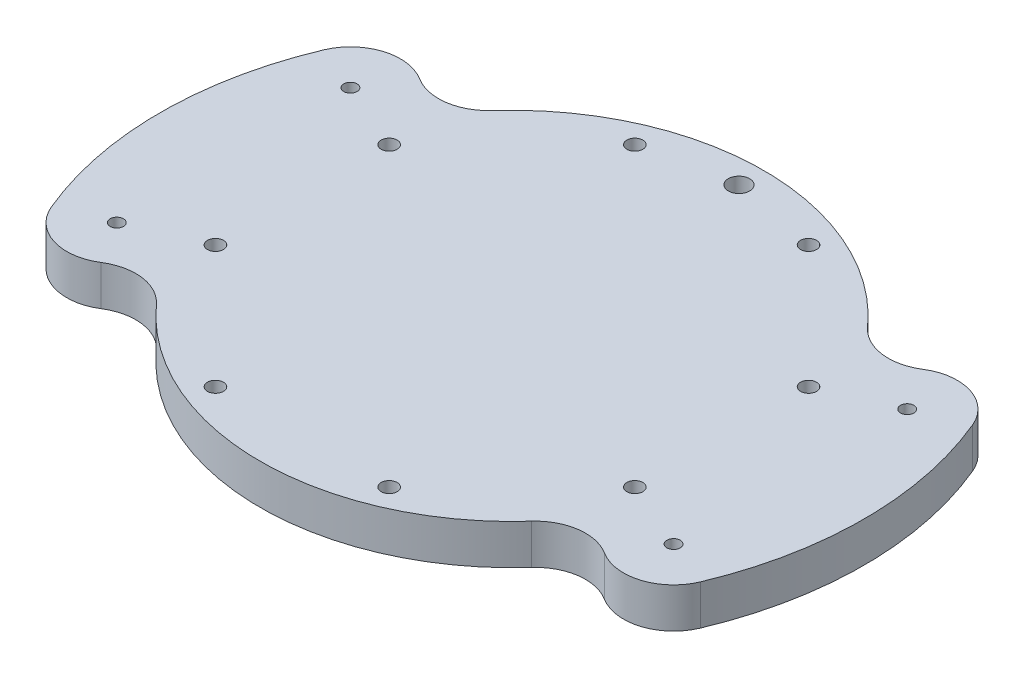
ISO-10303-21;
HEADER;
FILE_DESCRIPTION(('STEP AP214'),'2;1');
FILE_NAME('part.step','',(''),(''),'','','');
FILE_SCHEMA(('AUTOMOTIVE_DESIGN { 1 0 10303 214 1 1 1 1 }'));
ENDSEC;
DATA;
#1=APPLICATION_CONTEXT('core data for automotive mechanical design processes');
#2=APPLICATION_PROTOCOL_DEFINITION('international standard','automotive_design',2000,#1);
#3=PRODUCT_CONTEXT('',#1,'mechanical');
#4=PRODUCT('Part','Part','',(#3));
#5=PRODUCT_RELATED_PRODUCT_CATEGORY('part','',(#4));
#6=PRODUCT_DEFINITION_FORMATION('','',#4);
#7=PRODUCT_DEFINITION_CONTEXT('part definition',#1,'design');
#8=PRODUCT_DEFINITION('design','',#6,#7);
#9=PRODUCT_DEFINITION_SHAPE('','',#8);
#10=(LENGTH_UNIT() NAMED_UNIT(*) SI_UNIT(.MILLI.,.METRE.));
#11=(NAMED_UNIT(*) PLANE_ANGLE_UNIT() SI_UNIT($,.RADIAN.));
#12=(NAMED_UNIT(*) SI_UNIT($,.STERADIAN.) SOLID_ANGLE_UNIT());
#13=UNCERTAINTY_MEASURE_WITH_UNIT(LENGTH_MEASURE(1.E-05),#10,'distance_accuracy_value','');
#14=(GEOMETRIC_REPRESENTATION_CONTEXT(3) GLOBAL_UNCERTAINTY_ASSIGNED_CONTEXT((#13)) GLOBAL_UNIT_ASSIGNED_CONTEXT((#10,
#11,#12)) REPRESENTATION_CONTEXT('',''));
#15=CARTESIAN_POINT('',(0.,0.,0.));
#16=DIRECTION('',(0.,0.,1.));
#17=DIRECTION('',(1.,0.,0.));
#18=AXIS2_PLACEMENT_3D('',#15,#16,#17);
#19=CARTESIAN_POINT('',(0.,6.,0.));
#20=DIRECTION('',(0.,-1.,0.));
#21=DIRECTION('',(0.,0.,-1.));
#22=AXIS2_PLACEMENT_3D('',#19,#20,#21);
#23=PLANE('',#22);
#24=CARTESIAN_POINT('',(-13.011236700413,6.,31.4119041053838));
#25=DIRECTION('',(0.,-1.,0.));
#26=DIRECTION('',(0.,0.,-1.));
#27=AXIS2_PLACEMENT_3D('',#24,#25,#26);
#28=CIRCLE('',#27,1.2);
#29=CARTESIAN_POINT('',(-13.011236700413,6.,30.2119041053838));
#30=VERTEX_POINT('',#29);
#31=EDGE_CURVE('E635',#30,#30,#28,.T.);
#32=ORIENTED_EDGE('',*,*,#31,.T.);
#33=EDGE_LOOP('',(#32));
#34=FACE_BOUND('',#33,.T.);
#35=CARTESIAN_POINT('',(13.0112367004131,6.,31.4119041053837));
#36=DIRECTION('',(0.,-1.,0.));
#37=DIRECTION('',(0.,0.,-1.));
#38=AXIS2_PLACEMENT_3D('',#35,#36,#37);
#39=CIRCLE('',#38,1.2);
#40=CARTESIAN_POINT('',(13.0112367004131,6.,30.2119041053837));
#41=VERTEX_POINT('',#40);
#42=EDGE_CURVE('E645',#41,#41,#39,.T.);
#43=ORIENTED_EDGE('',*,*,#42,.T.);
#44=EDGE_LOOP('',(#43));
#45=FACE_BOUND('',#44,.T.);
#46=CARTESIAN_POINT('',(31.4119041053838,6.,13.011236700413));
#47=DIRECTION('',(0.,-1.,0.));
#48=DIRECTION('',(0.,0.,-1.));
#49=AXIS2_PLACEMENT_3D('',#46,#47,#48);
#50=CIRCLE('',#49,1.2);
#51=CARTESIAN_POINT('',(31.4119041053838,6.,11.811236700413));
#52=VERTEX_POINT('',#51);
#53=EDGE_CURVE('E654',#52,#52,#50,.T.);
#54=ORIENTED_EDGE('',*,*,#53,.T.);
#55=EDGE_LOOP('',(#54));
#56=FACE_BOUND('',#55,.T.);
#57=CARTESIAN_POINT('',(31.4119041053837,6.,-13.0112367004131));
#58=DIRECTION('',(0.,-1.,0.));
#59=DIRECTION('',(0.,0.,-1.));
#60=AXIS2_PLACEMENT_3D('',#57,#58,#59);
#61=CIRCLE('',#60,1.2);
#62=CARTESIAN_POINT('',(31.4119041053837,6.,-14.2112367004131));
#63=VERTEX_POINT('',#62);
#64=EDGE_CURVE('E663',#63,#63,#61,.T.);
#65=ORIENTED_EDGE('',*,*,#64,.T.);
#66=EDGE_LOOP('',(#65));
#67=FACE_BOUND('',#66,.T.);
#68=CARTESIAN_POINT('',(13.011236700413,6.,-31.4119041053838));
#69=DIRECTION('',(0.,-1.,0.));
#70=DIRECTION('',(0.,0.,-1.));
#71=AXIS2_PLACEMENT_3D('',#68,#69,#70);
#72=CIRCLE('',#71,1.2);
#73=CARTESIAN_POINT('',(13.011236700413,6.,-32.6119041053838));
#74=VERTEX_POINT('',#73);
#75=EDGE_CURVE('E672',#74,#74,#72,.T.);
#76=ORIENTED_EDGE('',*,*,#75,.T.);
#77=EDGE_LOOP('',(#76));
#78=FACE_BOUND('',#77,.T.);
#79=CARTESIAN_POINT('',(-13.0112367004131,6.,-31.4119041053837));
#80=DIRECTION('',(0.,-1.,0.));
#81=DIRECTION('',(0.,0.,-1.));
#82=AXIS2_PLACEMENT_3D('',#79,#80,#81);
#83=CIRCLE('',#82,1.2);
#84=CARTESIAN_POINT('',(-13.0112367004131,6.,-32.6119041053837));
#85=VERTEX_POINT('',#84);
#86=EDGE_CURVE('E681',#85,#85,#83,.T.);
#87=ORIENTED_EDGE('',*,*,#86,.T.);
#88=EDGE_LOOP('',(#87));
#89=FACE_BOUND('',#88,.T.);
#90=CARTESIAN_POINT('',(-31.4119041053838,6.,-13.011236700413));
#91=DIRECTION('',(0.,-1.,0.));
#92=DIRECTION('',(0.,0.,-1.));
#93=AXIS2_PLACEMENT_3D('',#90,#91,#92);
#94=CIRCLE('',#93,1.2);
#95=CARTESIAN_POINT('',(-31.4119041053838,6.,-14.211236700413));
#96=VERTEX_POINT('',#95);
#97=EDGE_CURVE('E690',#96,#96,#94,.T.);
#98=ORIENTED_EDGE('',*,*,#97,.T.);
#99=EDGE_LOOP('',(#98));
#100=FACE_BOUND('',#99,.T.);
#101=CARTESIAN_POINT('',(-31.4119041053837,6.,13.0112367004131));
#102=DIRECTION('',(0.,-1.,0.));
#103=DIRECTION('',(0.,0.,-1.));
#104=AXIS2_PLACEMENT_3D('',#101,#102,#103);
#105=CIRCLE('',#104,1.2);
#106=CARTESIAN_POINT('',(-31.4119041053837,6.,11.8112367004131));
#107=VERTEX_POINT('',#106);
#108=EDGE_CURVE('E225',#107,#107,#105,.T.);
#109=ORIENTED_EDGE('',*,*,#108,.T.);
#110=EDGE_LOOP('',(#109));
#111=FACE_BOUND('',#110,.T.);
#112=CARTESIAN_POINT('',(0.,6.,-34.));
#113=DIRECTION('',(0.,1.,0.));
#114=DIRECTION('',(0.,0.,1.));
#115=AXIS2_PLACEMENT_3D('',#112,#113,#114);
#116=CIRCLE('',#115,1.6);
#117=CARTESIAN_POINT('',(0.,6.,-32.4));
#118=VERTEX_POINT('',#117);
#119=EDGE_CURVE('E220',#118,#118,#116,.T.);
#120=ORIENTED_EDGE('',*,*,#119,.F.);
#121=EDGE_LOOP('',(#120));
#122=FACE_BOUND('',#121,.T.);
#123=CARTESIAN_POINT('',(-41.7019259147584,6.,-17.5));
#124=DIRECTION('',(0.,1.,0.));
#125=DIRECTION('',(0.,0.,-1.));
#126=AXIS2_PLACEMENT_3D('',#123,#124,#125);
#127=CIRCLE('',#126,0.999999999999998);
#128=CARTESIAN_POINT('',(-41.7019259147584,6.,-18.5));
#129=VERTEX_POINT('',#128);
#130=EDGE_CURVE('E236',#129,#129,#127,.T.);
#131=ORIENTED_EDGE('',*,*,#130,.F.);
#132=EDGE_LOOP('',(#131));
#133=FACE_BOUND('',#132,.T.);
#134=CARTESIAN_POINT('',(0.,6.,0.));
#135=DIRECTION('',(0.,1.,0.));
#136=DIRECTION('',(0.,0.,1.));
#137=AXIS2_PLACEMENT_3D('',#134,#135,#136);
#138=CIRCLE('',#137,37.725);
#139=CARTESIAN_POINT('',(-28.0981033127079,6.,25.1728467843506));
#140=VERTEX_POINT('',#139);
#141=CARTESIAN_POINT('',(28.0981033127079,6.,25.1728467843506));
#142=VERTEX_POINT('',#141);
#143=EDGE_CURVE('E163',#140,#142,#138,.T.);
#144=ORIENTED_EDGE('',*,*,#143,.T.);
#145=CARTESIAN_POINT('',(33.6842073510197,6.,30.1773888885953));
#146=DIRECTION('',(0.,-1.,0.));
#147=DIRECTION('',(0.,0.,-1.));
#148=AXIS2_PLACEMENT_3D('',#145,#146,#147);
#149=CIRCLE('',#148,7.5);
#150=CARTESIAN_POINT('',(37.693066632889,6.,23.8386944442976));
#151=VERTEX_POINT('',#150);
#152=EDGE_CURVE('E50',#142,#151,#149,.T.);
#153=ORIENTED_EDGE('',*,*,#152,.T.);
#154=CARTESIAN_POINT('',(41.7019259147584,6.,17.5));
#155=DIRECTION('',(0.,-1.,0.));
#156=DIRECTION('',(0.,0.,-1.));
#157=AXIS2_PLACEMENT_3D('',#154,#155,#156);
#158=CIRCLE('',#157,7.5);
#159=CARTESIAN_POINT('',(48.6176681891794,6.,20.4021558872305));
#160=VERTEX_POINT('',#159);
#161=EDGE_CURVE('E179',#151,#160,#158,.F.);
#162=ORIENTED_EDGE('',*,*,#161,.T.);
#163=CARTESIAN_POINT('',(0.,6.,0.));
#164=DIRECTION('',(0.,1.,0.));
#165=DIRECTION('',(0.,0.,-1.));
#166=AXIS2_PLACEMENT_3D('',#163,#164,#165);
#167=CIRCLE('',#166,52.725);
#168=CARTESIAN_POINT('',(48.6176681891794,6.,-20.4021558872305));
#169=VERTEX_POINT('',#168);
#170=EDGE_CURVE('E145',#160,#169,#167,.T.);
#171=ORIENTED_EDGE('',*,*,#170,.T.);
#172=CARTESIAN_POINT('',(41.7019259147584,6.,-17.5));
#173=DIRECTION('',(0.,-1.,0.));
#174=DIRECTION('',(0.,0.,-1.));
#175=AXIS2_PLACEMENT_3D('',#172,#173,#174);
#176=CIRCLE('',#175,7.5);
#177=CARTESIAN_POINT('',(37.693066632889,6.,-23.8386944442976));
#178=VERTEX_POINT('',#177);
#179=EDGE_CURVE('E175',#169,#178,#176,.F.);
#180=ORIENTED_EDGE('',*,*,#179,.T.);
#181=CARTESIAN_POINT('',(33.6842073510197,6.,-30.1773888885953));
#182=DIRECTION('',(0.,-1.,0.));
#183=DIRECTION('',(0.,0.,-1.));
#184=AXIS2_PLACEMENT_3D('',#181,#182,#183);
#185=CIRCLE('',#184,7.5);
#186=CARTESIAN_POINT('',(28.0981033127079,6.,-25.1728467843506));
#187=VERTEX_POINT('',#186);
#188=EDGE_CURVE('E203',#178,#187,#185,.T.);
#189=ORIENTED_EDGE('',*,*,#188,.T.);
#190=CARTESIAN_POINT('',(0.,6.,0.));
#191=DIRECTION('',(0.,1.,0.));
#192=DIRECTION('',(0.,0.,-1.));
#193=AXIS2_PLACEMENT_3D('',#190,#191,#192);
#194=CIRCLE('',#193,37.725);
#195=CARTESIAN_POINT('',(-28.0981033127079,6.,-25.1728467843506));
#196=VERTEX_POINT('',#195);
#197=EDGE_CURVE('E250',#187,#196,#194,.T.);
#198=ORIENTED_EDGE('',*,*,#197,.T.);
#199=CARTESIAN_POINT('',(-33.6842073510197,6.,-30.1773888885953));
#200=DIRECTION('',(0.,-1.,0.));
#201=DIRECTION('',(0.,0.,-1.));
#202=AXIS2_PLACEMENT_3D('',#199,#200,#201);
#203=CIRCLE('',#202,7.5);
#204=CARTESIAN_POINT('',(-37.693066632889,6.,-23.8386944442976));
#205=VERTEX_POINT('',#204);
#206=EDGE_CURVE('E11',#196,#205,#203,.T.);
#207=ORIENTED_EDGE('',*,*,#206,.T.);
#208=CARTESIAN_POINT('',(-41.7019259147584,6.,-17.5));
#209=DIRECTION('',(0.,-1.,0.));
#210=DIRECTION('',(0.,0.,-1.));
#211=AXIS2_PLACEMENT_3D('',#208,#209,#210);
#212=CIRCLE('',#211,7.5);
#213=CARTESIAN_POINT('',(-48.6176681891794,6.,-20.4021558872305));
#214=VERTEX_POINT('',#213);
#215=EDGE_CURVE('E134',#205,#214,#212,.F.);
#216=ORIENTED_EDGE('',*,*,#215,.T.);
#217=CARTESIAN_POINT('',(0.,6.,0.));
#218=DIRECTION('',(0.,1.,0.));
#219=DIRECTION('',(0.,0.,1.));
#220=AXIS2_PLACEMENT_3D('',#217,#218,#219);
#221=CIRCLE('',#220,52.725);
#222=CARTESIAN_POINT('',(-48.6176681891794,6.,20.4021558872305));
#223=VERTEX_POINT('',#222);
#224=EDGE_CURVE('E252',#214,#223,#221,.T.);
#225=ORIENTED_EDGE('',*,*,#224,.T.);
#226=CARTESIAN_POINT('',(-41.7019259147584,6.,17.5));
#227=DIRECTION('',(0.,-1.,0.));
#228=DIRECTION('',(0.,0.,-1.));
#229=AXIS2_PLACEMENT_3D('',#226,#227,#228);
#230=CIRCLE('',#229,7.5);
#231=CARTESIAN_POINT('',(-37.693066632889,6.,23.8386944442976));
#232=VERTEX_POINT('',#231);
#233=EDGE_CURVE('E177',#223,#232,#230,.F.);
#234=ORIENTED_EDGE('',*,*,#233,.T.);
#235=CARTESIAN_POINT('',(-33.6842073510197,6.,30.1773888885953));
#236=DIRECTION('',(0.,-1.,0.));
#237=DIRECTION('',(0.,0.,-1.));
#238=AXIS2_PLACEMENT_3D('',#235,#236,#237);
#239=CIRCLE('',#238,7.5);
#240=EDGE_CURVE('E199',#232,#140,#239,.T.);
#241=ORIENTED_EDGE('',*,*,#240,.T.);
#242=EDGE_LOOP('',(#144,#153,#162,#171,#180,#189,#198,#207,#216,#225,#234,#241));
#243=FACE_BOUND('',#242,.T.);
#244=CARTESIAN_POINT('',(41.7019259147584,6.,-17.5));
#245=DIRECTION('',(0.,1.,0.));
#246=DIRECTION('',(0.,0.,1.));
#247=AXIS2_PLACEMENT_3D('',#244,#245,#246);
#248=CIRCLE('',#247,0.999999999999998);
#249=CARTESIAN_POINT('',(41.7019259147584,6.,-16.5));
#250=VERTEX_POINT('',#249);
#251=EDGE_CURVE('E154',#250,#250,#248,.T.);
#252=ORIENTED_EDGE('',*,*,#251,.F.);
#253=EDGE_LOOP('',(#252));
#254=FACE_BOUND('',#253,.T.);
#255=CARTESIAN_POINT('',(41.7019259147584,6.,17.5));
#256=DIRECTION('',(0.,1.,0.));
#257=DIRECTION('',(0.,0.,1.));
#258=AXIS2_PLACEMENT_3D('',#255,#256,#257);
#259=CIRCLE('',#258,0.999999999999998);
#260=CARTESIAN_POINT('',(41.7019259147584,6.,18.5));
#261=VERTEX_POINT('',#260);
#262=EDGE_CURVE('E242',#261,#261,#259,.T.);
#263=ORIENTED_EDGE('',*,*,#262,.F.);
#264=EDGE_LOOP('',(#263));
#265=FACE_BOUND('',#264,.T.);
#266=CARTESIAN_POINT('',(-41.7019259147584,6.,17.5));
#267=DIRECTION('',(0.,1.,0.));
#268=DIRECTION('',(0.,0.,-1.));
#269=AXIS2_PLACEMENT_3D('',#266,#267,#268);
#270=CIRCLE('',#269,0.999999999999998);
#271=CARTESIAN_POINT('',(-41.7019259147584,6.,16.5));
#272=VERTEX_POINT('',#271);
#273=EDGE_CURVE('E230',#272,#272,#270,.T.);
#274=ORIENTED_EDGE('',*,*,#273,.F.);
#275=EDGE_LOOP('',(#274));
#276=FACE_BOUND('',#275,.T.);
#277=ADVANCED_FACE('F33',(#34,#45,#56,#67,#78,#89,#100,#111,#122,#133,#243,#254,#265,#276),#23,.F.);
#278=CARTESIAN_POINT('',(0.,0.,0.));
#279=DIRECTION('',(0.,-1.,0.));
#280=DIRECTION('',(0.,0.,-1.));
#281=AXIS2_PLACEMENT_3D('',#278,#279,#280);
#282=PLANE('',#281);
#283=CARTESIAN_POINT('',(-13.011236700413,0.,31.4119041053838));
#284=DIRECTION('',(0.,-1.,0.));
#285=DIRECTION('',(0.,0.,-1.));
#286=AXIS2_PLACEMENT_3D('',#283,#284,#285);
#287=CIRCLE('',#286,2.2);
#288=CARTESIAN_POINT('',(-13.011236700413,0.,29.2119041053838));
#289=VERTEX_POINT('',#288);
#290=EDGE_CURVE('E633',#289,#289,#287,.T.);
#291=ORIENTED_EDGE('',*,*,#290,.F.);
#292=EDGE_LOOP('',(#291));
#293=FACE_BOUND('',#292,.T.);
#294=CARTESIAN_POINT('',(13.0112367004131,0.,31.4119041053837));
#295=DIRECTION('',(0.,-1.,0.));
#296=DIRECTION('',(0.,0.,-1.));
#297=AXIS2_PLACEMENT_3D('',#294,#295,#296);
#298=CIRCLE('',#297,2.2);
#299=CARTESIAN_POINT('',(13.0112367004131,0.,29.2119041053837));
#300=VERTEX_POINT('',#299);
#301=EDGE_CURVE('E639',#300,#300,#298,.T.);
#302=ORIENTED_EDGE('',*,*,#301,.F.);
#303=EDGE_LOOP('',(#302));
#304=FACE_BOUND('',#303,.T.);
#305=CARTESIAN_POINT('',(31.4119041053838,0.,13.011236700413));
#306=DIRECTION('',(0.,-1.,0.));
#307=DIRECTION('',(0.,0.,-1.));
#308=AXIS2_PLACEMENT_3D('',#305,#306,#307);
#309=CIRCLE('',#308,2.2);
#310=CARTESIAN_POINT('',(31.4119041053838,0.,10.811236700413));
#311=VERTEX_POINT('',#310);
#312=EDGE_CURVE('E648',#311,#311,#309,.T.);
#313=ORIENTED_EDGE('',*,*,#312,.F.);
#314=EDGE_LOOP('',(#313));
#315=FACE_BOUND('',#314,.T.);
#316=CARTESIAN_POINT('',(31.4119041053837,0.,-13.0112367004131));
#317=DIRECTION('',(0.,-1.,0.));
#318=DIRECTION('',(0.,0.,-1.));
#319=AXIS2_PLACEMENT_3D('',#316,#317,#318);
#320=CIRCLE('',#319,2.2);
#321=CARTESIAN_POINT('',(31.4119041053837,0.,-15.2112367004131));
#322=VERTEX_POINT('',#321);
#323=EDGE_CURVE('E657',#322,#322,#320,.T.);
#324=ORIENTED_EDGE('',*,*,#323,.F.);
#325=EDGE_LOOP('',(#324));
#326=FACE_BOUND('',#325,.T.);
#327=CARTESIAN_POINT('',(13.011236700413,0.,-31.4119041053838));
#328=DIRECTION('',(0.,-1.,0.));
#329=DIRECTION('',(0.,0.,-1.));
#330=AXIS2_PLACEMENT_3D('',#327,#328,#329);
#331=CIRCLE('',#330,2.2);
#332=CARTESIAN_POINT('',(13.011236700413,0.,-33.6119041053838));
#333=VERTEX_POINT('',#332);
#334=EDGE_CURVE('E666',#333,#333,#331,.T.);
#335=ORIENTED_EDGE('',*,*,#334,.F.);
#336=EDGE_LOOP('',(#335));
#337=FACE_BOUND('',#336,.T.);
#338=CARTESIAN_POINT('',(-13.0112367004131,0.,-31.4119041053837));
#339=DIRECTION('',(0.,-1.,0.));
#340=DIRECTION('',(0.,0.,-1.));
#341=AXIS2_PLACEMENT_3D('',#338,#339,#340);
#342=CIRCLE('',#341,2.2);
#343=CARTESIAN_POINT('',(-13.0112367004131,0.,-33.6119041053837));
#344=VERTEX_POINT('',#343);
#345=EDGE_CURVE('E675',#344,#344,#342,.T.);
#346=ORIENTED_EDGE('',*,*,#345,.F.);
#347=EDGE_LOOP('',(#346));
#348=FACE_BOUND('',#347,.T.);
#349=CARTESIAN_POINT('',(-31.4119041053838,0.,-13.011236700413));
#350=DIRECTION('',(0.,-1.,0.));
#351=DIRECTION('',(0.,0.,-1.));
#352=AXIS2_PLACEMENT_3D('',#349,#350,#351);
#353=CIRCLE('',#352,2.2);
#354=CARTESIAN_POINT('',(-31.4119041053838,0.,-15.211236700413));
#355=VERTEX_POINT('',#354);
#356=EDGE_CURVE('E684',#355,#355,#353,.T.);
#357=ORIENTED_EDGE('',*,*,#356,.F.);
#358=EDGE_LOOP('',(#357));
#359=FACE_BOUND('',#358,.T.);
#360=CARTESIAN_POINT('',(-31.4119041053837,0.,13.0112367004131));
#361=DIRECTION('',(0.,-1.,0.));
#362=DIRECTION('',(0.,0.,-1.));
#363=AXIS2_PLACEMENT_3D('',#360,#361,#362);
#364=CIRCLE('',#363,2.2);
#365=CARTESIAN_POINT('',(-31.4119041053837,0.,10.8112367004131));
#366=VERTEX_POINT('',#365);
#367=EDGE_CURVE('E693',#366,#366,#364,.T.);
#368=ORIENTED_EDGE('',*,*,#367,.F.);
#369=EDGE_LOOP('',(#368));
#370=FACE_BOUND('',#369,.T.);
#371=CARTESIAN_POINT('',(0.,0.,-34.));
#372=DIRECTION('',(0.,1.,0.));
#373=DIRECTION('',(0.,0.,1.));
#374=AXIS2_PLACEMENT_3D('',#371,#372,#373);
#375=CIRCLE('',#374,1.6);
#376=CARTESIAN_POINT('',(0.,0.,-32.4));
#377=VERTEX_POINT('',#376);
#378=EDGE_CURVE('E215',#377,#377,#375,.T.);
#379=ORIENTED_EDGE('',*,*,#378,.T.);
#380=EDGE_LOOP('',(#379));
#381=FACE_BOUND('',#380,.T.);
#382=CARTESIAN_POINT('',(-41.7019259147584,0.,-17.5));
#383=DIRECTION('',(0.,1.,0.));
#384=DIRECTION('',(0.,0.,-1.));
#385=AXIS2_PLACEMENT_3D('',#382,#383,#384);
#386=CIRCLE('',#385,0.999999999999998);
#387=CARTESIAN_POINT('',(-41.7019259147584,0.,-18.5));
#388=VERTEX_POINT('',#387);
#389=EDGE_CURVE('E233',#388,#388,#386,.T.);
#390=ORIENTED_EDGE('',*,*,#389,.T.);
#391=EDGE_LOOP('',(#390));
#392=FACE_BOUND('',#391,.T.);
#393=CARTESIAN_POINT('',(0.,0.,0.));
#394=DIRECTION('',(0.,1.,0.));
#395=DIRECTION('',(0.,0.,-1.));
#396=AXIS2_PLACEMENT_3D('',#393,#394,#395);
#397=CIRCLE('',#396,52.725);
#398=CARTESIAN_POINT('',(48.6176681891794,0.,20.4021558872305));
#399=VERTEX_POINT('',#398);
#400=CARTESIAN_POINT('',(48.6176681891794,0.,-20.4021558872305));
#401=VERTEX_POINT('',#400);
#402=EDGE_CURVE('E142',#399,#401,#397,.T.);
#403=ORIENTED_EDGE('',*,*,#402,.F.);
#404=CARTESIAN_POINT('',(41.7019259147584,0.,17.5));
#405=DIRECTION('',(0.,-1.,0.));
#406=DIRECTION('',(0.,0.,-1.));
#407=AXIS2_PLACEMENT_3D('',#404,#405,#406);
#408=CIRCLE('',#407,7.5);
#409=CARTESIAN_POINT('',(37.693066632889,0.,23.8386944442976));
#410=VERTEX_POINT('',#409);
#411=EDGE_CURVE('E125',#399,#410,#408,.T.);
#412=ORIENTED_EDGE('',*,*,#411,.T.);
#413=CARTESIAN_POINT('',(33.6842073510197,0.,30.1773888885953));
#414=DIRECTION('',(0.,-1.,0.));
#415=DIRECTION('',(0.,0.,-1.));
#416=AXIS2_PLACEMENT_3D('',#413,#414,#415);
#417=CIRCLE('',#416,7.5);
#418=CARTESIAN_POINT('',(28.0981033127079,0.,25.1728467843506));
#419=VERTEX_POINT('',#418);
#420=EDGE_CURVE('E194',#410,#419,#417,.F.);
#421=ORIENTED_EDGE('',*,*,#420,.T.);
#422=CARTESIAN_POINT('',(0.,0.,0.));
#423=DIRECTION('',(0.,1.,0.));
#424=DIRECTION('',(0.,0.,1.));
#425=AXIS2_PLACEMENT_3D('',#422,#423,#424);
#426=CIRCLE('',#425,37.725);
#427=CARTESIAN_POINT('',(-28.0981033127079,0.,25.1728467843506));
#428=VERTEX_POINT('',#427);
#429=EDGE_CURVE('E168',#428,#419,#426,.T.);
#430=ORIENTED_EDGE('',*,*,#429,.F.);
#431=CARTESIAN_POINT('',(-33.6842073510197,0.,30.1773888885953));
#432=DIRECTION('',(0.,-1.,0.));
#433=DIRECTION('',(0.,0.,-1.));
#434=AXIS2_PLACEMENT_3D('',#431,#432,#433);
#435=CIRCLE('',#434,7.5);
#436=CARTESIAN_POINT('',(-37.693066632889,0.,23.8386944442976));
#437=VERTEX_POINT('',#436);
#438=EDGE_CURVE('E197',#428,#437,#435,.F.);
#439=ORIENTED_EDGE('',*,*,#438,.T.);
#440=CARTESIAN_POINT('',(-41.7019259147584,0.,17.5));
#441=DIRECTION('',(0.,-1.,0.));
#442=DIRECTION('',(0.,0.,-1.));
#443=AXIS2_PLACEMENT_3D('',#440,#441,#442);
#444=CIRCLE('',#443,7.5);
#445=CARTESIAN_POINT('',(-48.6176681891794,0.,20.4021558872305));
#446=VERTEX_POINT('',#445);
#447=EDGE_CURVE('E135',#437,#446,#444,.T.);
#448=ORIENTED_EDGE('',*,*,#447,.T.);
#449=CARTESIAN_POINT('',(0.,0.,0.));
#450=DIRECTION('',(0.,1.,0.));
#451=DIRECTION('',(0.,0.,1.));
#452=AXIS2_PLACEMENT_3D('',#449,#450,#451);
#453=CIRCLE('',#452,52.725);
#454=CARTESIAN_POINT('',(-48.6176681891794,0.,-20.4021558872305));
#455=VERTEX_POINT('',#454);
#456=EDGE_CURVE('E157',#455,#446,#453,.T.);
#457=ORIENTED_EDGE('',*,*,#456,.F.);
#458=CARTESIAN_POINT('',(-41.7019259147584,0.,-17.5));
#459=DIRECTION('',(0.,-1.,0.));
#460=DIRECTION('',(0.,0.,-1.));
#461=AXIS2_PLACEMENT_3D('',#458,#459,#460);
#462=CIRCLE('',#461,7.5);
#463=CARTESIAN_POINT('',(-37.693066632889,0.,-23.8386944442976));
#464=VERTEX_POINT('',#463);
#465=EDGE_CURVE('E146',#455,#464,#462,.T.);
#466=ORIENTED_EDGE('',*,*,#465,.T.);
#467=CARTESIAN_POINT('',(-33.6842073510197,0.,-30.1773888885953));
#468=DIRECTION('',(0.,-1.,0.));
#469=DIRECTION('',(0.,0.,-1.));
#470=AXIS2_PLACEMENT_3D('',#467,#468,#469);
#471=CIRCLE('',#470,7.5);
#472=CARTESIAN_POINT('',(-28.0981033127079,0.,-25.1728467843506));
#473=VERTEX_POINT('',#472);
#474=EDGE_CURVE('E42',#464,#473,#471,.F.);
#475=ORIENTED_EDGE('',*,*,#474,.T.);
#476=CARTESIAN_POINT('',(0.,0.,0.));
#477=DIRECTION('',(0.,1.,0.));
#478=DIRECTION('',(0.,0.,-1.));
#479=AXIS2_PLACEMENT_3D('',#476,#477,#478);
#480=CIRCLE('',#479,37.725);
#481=CARTESIAN_POINT('',(28.0981033127079,0.,-25.1728467843506));
#482=VERTEX_POINT('',#481);
#483=EDGE_CURVE('E153',#482,#473,#480,.T.);
#484=ORIENTED_EDGE('',*,*,#483,.F.);
#485=CARTESIAN_POINT('',(33.6842073510197,0.,-30.1773888885953));
#486=DIRECTION('',(0.,-1.,0.));
#487=DIRECTION('',(0.,0.,-1.));
#488=AXIS2_PLACEMENT_3D('',#485,#486,#487);
#489=CIRCLE('',#488,7.5);
#490=CARTESIAN_POINT('',(37.693066632889,0.,-23.8386944442976));
#491=VERTEX_POINT('',#490);
#492=EDGE_CURVE('E201',#482,#491,#489,.F.);
#493=ORIENTED_EDGE('',*,*,#492,.T.);
#494=CARTESIAN_POINT('',(41.7019259147584,0.,-17.5));
#495=DIRECTION('',(0.,-1.,0.));
#496=DIRECTION('',(0.,0.,-1.));
#497=AXIS2_PLACEMENT_3D('',#494,#495,#496);
#498=CIRCLE('',#497,7.5);
#499=EDGE_CURVE('E152',#491,#401,#498,.T.);
#500=ORIENTED_EDGE('',*,*,#499,.T.);
#501=EDGE_LOOP('',(#403,#412,#421,#430,#439,#448,#457,#466,#475,#484,#493,#500));
#502=FACE_BOUND('',#501,.T.);
#503=CARTESIAN_POINT('',(41.7019259147584,0.,-17.5));
#504=DIRECTION('',(0.,1.,0.));
#505=DIRECTION('',(0.,0.,1.));
#506=AXIS2_PLACEMENT_3D('',#503,#504,#505);
#507=CIRCLE('',#506,0.999999999999998);
#508=CARTESIAN_POINT('',(41.7019259147584,0.,-16.5));
#509=VERTEX_POINT('',#508);
#510=EDGE_CURVE('E160',#509,#509,#507,.T.);
#511=ORIENTED_EDGE('',*,*,#510,.T.);
#512=EDGE_LOOP('',(#511));
#513=FACE_BOUND('',#512,.T.);
#514=CARTESIAN_POINT('',(41.7019259147584,0.,17.5));
#515=DIRECTION('',(0.,1.,0.));
#516=DIRECTION('',(0.,0.,1.));
#517=AXIS2_PLACEMENT_3D('',#514,#515,#516);
#518=CIRCLE('',#517,0.999999999999998);
#519=CARTESIAN_POINT('',(41.7019259147584,0.,18.5));
#520=VERTEX_POINT('',#519);
#521=EDGE_CURVE('E239',#520,#520,#518,.T.);
#522=ORIENTED_EDGE('',*,*,#521,.T.);
#523=EDGE_LOOP('',(#522));
#524=FACE_BOUND('',#523,.T.);
#525=CARTESIAN_POINT('',(-41.7019259147584,0.,17.5));
#526=DIRECTION('',(0.,1.,0.));
#527=DIRECTION('',(0.,0.,-1.));
#528=AXIS2_PLACEMENT_3D('',#525,#526,#527);
#529=CIRCLE('',#528,0.999999999999998);
#530=CARTESIAN_POINT('',(-41.7019259147584,0.,16.5));
#531=VERTEX_POINT('',#530);
#532=EDGE_CURVE('E207',#531,#531,#529,.T.);
#533=ORIENTED_EDGE('',*,*,#532,.T.);
#534=EDGE_LOOP('',(#533));
#535=FACE_BOUND('',#534,.T.);
#536=ADVANCED_FACE('F149',(#293,#304,#315,#326,#337,#348,#359,#370,#381,#392,#502,#513,#524,
#535),#282,.T.);
#537=CARTESIAN_POINT('',(0.,6.,0.));
#538=DIRECTION('',(0.,-1.,0.));
#539=DIRECTION('',(0.,0.,-1.));
#540=AXIS2_PLACEMENT_3D('',#537,#538,#539);
#541=CYLINDRICAL_SURFACE('',#540,52.725);
#542=ORIENTED_EDGE('',*,*,#170,.F.);
#543=DIRECTION('',(0.,-1.,0.));
#544=VECTOR('',#543,1.);
#545=CARTESIAN_POINT('',(48.6176681891794,6.,20.4021558872305));
#546=LINE('',#545,#544);
#547=EDGE_CURVE('E129',#160,#399,#546,.T.);
#548=ORIENTED_EDGE('',*,*,#547,.T.);
#549=ORIENTED_EDGE('',*,*,#402,.T.);
#550=DIRECTION('',(0.,-1.,0.));
#551=VECTOR('',#550,1.);
#552=CARTESIAN_POINT('',(48.6176681891794,6.,-20.4021558872305));
#553=LINE('',#552,#551);
#554=EDGE_CURVE('E147',#401,#169,#553,.F.);
#555=ORIENTED_EDGE('',*,*,#554,.T.);
#556=EDGE_LOOP('',(#542,#548,#549,#555));
#557=FACE_BOUND('',#556,.T.);
#558=ADVANCED_FACE('F140',(#557),#541,.T.);
#559=CARTESIAN_POINT('',(0.,6.,0.));
#560=DIRECTION('',(0.,-1.,0.));
#561=DIRECTION('',(0.,0.,-1.));
#562=AXIS2_PLACEMENT_3D('',#559,#560,#561);
#563=CYLINDRICAL_SURFACE('',#562,37.725);
#564=ORIENTED_EDGE('',*,*,#197,.F.);
#565=DIRECTION('',(0.,-1.,0.));
#566=VECTOR('',#565,1.);
#567=CARTESIAN_POINT('',(28.0981033127079,6.,-25.1728467843506));
#568=LINE('',#567,#566);
#569=EDGE_CURVE('E192',#187,#482,#568,.T.);
#570=ORIENTED_EDGE('',*,*,#569,.T.);
#571=ORIENTED_EDGE('',*,*,#483,.T.);
#572=DIRECTION('',(0.,-1.,0.));
#573=VECTOR('',#572,1.);
#574=CARTESIAN_POINT('',(-28.0981033127079,6.,-25.1728467843506));
#575=LINE('',#574,#573);
#576=EDGE_CURVE('E190',#473,#196,#575,.F.);
#577=ORIENTED_EDGE('',*,*,#576,.T.);
#578=EDGE_LOOP('',(#564,#570,#571,#577));
#579=FACE_BOUND('',#578,.T.);
#580=ADVANCED_FACE('F268',(#579),#563,.T.);
#581=CARTESIAN_POINT('',(0.,6.,0.));
#582=DIRECTION('',(0.,-1.,0.));
#583=DIRECTION('',(0.,0.,-1.));
#584=AXIS2_PLACEMENT_3D('',#581,#582,#583);
#585=CYLINDRICAL_SURFACE('',#584,52.725);
#586=ORIENTED_EDGE('',*,*,#456,.T.);
#587=DIRECTION('',(0.,-1.,0.));
#588=VECTOR('',#587,1.);
#589=CARTESIAN_POINT('',(-48.6176681891794,6.,20.4021558872305));
#590=LINE('',#589,#588);
#591=EDGE_CURVE('E187',#446,#223,#590,.F.);
#592=ORIENTED_EDGE('',*,*,#591,.T.);
#593=ORIENTED_EDGE('',*,*,#224,.F.);
#594=DIRECTION('',(0.,-1.,0.));
#595=VECTOR('',#594,1.);
#596=CARTESIAN_POINT('',(-48.6176681891794,6.,-20.4021558872305));
#597=LINE('',#596,#595);
#598=EDGE_CURVE('E184',#214,#455,#597,.T.);
#599=ORIENTED_EDGE('',*,*,#598,.T.);
#600=EDGE_LOOP('',(#586,#592,#593,#599));
#601=FACE_BOUND('',#600,.T.);
#602=ADVANCED_FACE('F276',(#601),#585,.T.);
#603=CARTESIAN_POINT('',(0.,6.,0.));
#604=DIRECTION('',(0.,-1.,0.));
#605=DIRECTION('',(0.,0.,-1.));
#606=AXIS2_PLACEMENT_3D('',#603,#604,#605);
#607=CYLINDRICAL_SURFACE('',#606,37.725);
#608=ORIENTED_EDGE('',*,*,#429,.T.);
#609=DIRECTION('',(0.,-1.,0.));
#610=VECTOR('',#609,1.);
#611=CARTESIAN_POINT('',(28.0981033127079,6.,25.1728467843506));
#612=LINE('',#611,#610);
#613=EDGE_CURVE('E58',#419,#142,#612,.F.);
#614=ORIENTED_EDGE('',*,*,#613,.T.);
#615=ORIENTED_EDGE('',*,*,#143,.F.);
#616=DIRECTION('',(0.,-1.,0.));
#617=VECTOR('',#616,1.);
#618=CARTESIAN_POINT('',(-28.0981033127079,6.,25.1728467843506));
#619=LINE('',#618,#617);
#620=EDGE_CURVE('E181',#140,#428,#619,.T.);
#621=ORIENTED_EDGE('',*,*,#620,.T.);
#622=EDGE_LOOP('',(#608,#614,#615,#621));
#623=FACE_BOUND('',#622,.T.);
#624=ADVANCED_FACE('F304',(#623),#607,.T.);
#625=CARTESIAN_POINT('',(41.7019259147584,6.,-17.5));
#626=DIRECTION('',(0.,-1.,0.));
#627=DIRECTION('',(0.,0.,-1.));
#628=AXIS2_PLACEMENT_3D('',#625,#626,#627);
#629=CYLINDRICAL_SURFACE('',#628,0.999999999999998);
#630=ORIENTED_EDGE('',*,*,#251,.T.);
#631=EDGE_LOOP('',(#630));
#632=FACE_BOUND('',#631,.T.);
#633=ORIENTED_EDGE('',*,*,#510,.F.);
#634=EDGE_LOOP('',(#633));
#635=FACE_BOUND('',#634,.T.);
#636=ADVANCED_FACE('F301',(#632,#635),#629,.F.);
#637=CARTESIAN_POINT('',(41.7019259147584,6.,17.5));
#638=DIRECTION('',(0.,-1.,0.));
#639=DIRECTION('',(0.,0.,-1.));
#640=AXIS2_PLACEMENT_3D('',#637,#638,#639);
#641=CYLINDRICAL_SURFACE('',#640,0.999999999999998);
#642=ORIENTED_EDGE('',*,*,#262,.T.);
#643=EDGE_LOOP('',(#642));
#644=FACE_BOUND('',#643,.T.);
#645=ORIENTED_EDGE('',*,*,#521,.F.);
#646=EDGE_LOOP('',(#645));
#647=FACE_BOUND('',#646,.T.);
#648=ADVANCED_FACE('F532',(#644,#647),#641,.F.);
#649=CARTESIAN_POINT('',(-41.7019259147584,6.,-17.5));
#650=DIRECTION('',(0.,-1.,0.));
#651=DIRECTION('',(0.,0.,-1.));
#652=AXIS2_PLACEMENT_3D('',#649,#650,#651);
#653=CYLINDRICAL_SURFACE('',#652,0.999999999999998);
#654=ORIENTED_EDGE('',*,*,#130,.T.);
#655=EDGE_LOOP('',(#654));
#656=FACE_BOUND('',#655,.T.);
#657=ORIENTED_EDGE('',*,*,#389,.F.);
#658=EDGE_LOOP('',(#657));
#659=FACE_BOUND('',#658,.T.);
#660=ADVANCED_FACE('F529',(#656,#659),#653,.F.);
#661=CARTESIAN_POINT('',(-41.7019259147584,6.,17.5));
#662=DIRECTION('',(0.,-1.,0.));
#663=DIRECTION('',(0.,0.,-1.));
#664=AXIS2_PLACEMENT_3D('',#661,#662,#663);
#665=CYLINDRICAL_SURFACE('',#664,0.999999999999998);
#666=ORIENTED_EDGE('',*,*,#273,.T.);
#667=EDGE_LOOP('',(#666));
#668=FACE_BOUND('',#667,.T.);
#669=ORIENTED_EDGE('',*,*,#532,.F.);
#670=EDGE_LOOP('',(#669));
#671=FACE_BOUND('',#670,.T.);
#672=ADVANCED_FACE('F318',(#668,#671),#665,.F.);
#673=CARTESIAN_POINT('',(33.6842073510197,6.,30.1773888885953));
#674=DIRECTION('',(0.,-1.,0.));
#675=DIRECTION('',(0.,0.,-1.));
#676=AXIS2_PLACEMENT_3D('',#673,#674,#675);
#677=CYLINDRICAL_SURFACE('',#676,7.5);
#678=DIRECTION('',(0.,1.,0.));
#679=VECTOR('',#678,1.);
#680=CARTESIAN_POINT('',(37.693066632889,0.,23.8386944442976));
#681=LINE('',#680,#679);
#682=EDGE_CURVE('E130',#151,#410,#681,.F.);
#683=ORIENTED_EDGE('',*,*,#682,.F.);
#684=ORIENTED_EDGE('',*,*,#152,.F.);
#685=ORIENTED_EDGE('',*,*,#613,.F.);
#686=ORIENTED_EDGE('',*,*,#420,.F.);
#687=EDGE_LOOP('',(#683,#684,#685,#686));
#688=FACE_BOUND('',#687,.T.);
#689=ADVANCED_FACE('F259',(#688),#677,.F.);
#690=CARTESIAN_POINT('',(41.7019259147584,6.,17.5));
#691=DIRECTION('',(0.,-1.,0.));
#692=DIRECTION('',(0.,0.,-1.));
#693=AXIS2_PLACEMENT_3D('',#690,#691,#692);
#694=CYLINDRICAL_SURFACE('',#693,7.5);
#695=ORIENTED_EDGE('',*,*,#161,.F.);
#696=ORIENTED_EDGE('',*,*,#682,.T.);
#697=ORIENTED_EDGE('',*,*,#411,.F.);
#698=ORIENTED_EDGE('',*,*,#547,.F.);
#699=EDGE_LOOP('',(#695,#696,#697,#698));
#700=FACE_BOUND('',#699,.T.);
#701=ADVANCED_FACE('F128',(#700),#694,.T.);
#702=CARTESIAN_POINT('',(-33.6842073510197,6.,30.1773888885953));
#703=DIRECTION('',(0.,-1.,0.));
#704=DIRECTION('',(0.,0.,-1.));
#705=AXIS2_PLACEMENT_3D('',#702,#703,#704);
#706=CYLINDRICAL_SURFACE('',#705,7.5);
#707=ORIENTED_EDGE('',*,*,#620,.F.);
#708=ORIENTED_EDGE('',*,*,#240,.F.);
#709=DIRECTION('',(0.,1.,0.));
#710=VECTOR('',#709,1.);
#711=CARTESIAN_POINT('',(-37.693066632889,6.,23.8386944442976));
#712=LINE('',#711,#710);
#713=EDGE_CURVE('E208',#437,#232,#712,.T.);
#714=ORIENTED_EDGE('',*,*,#713,.F.);
#715=ORIENTED_EDGE('',*,*,#438,.F.);
#716=EDGE_LOOP('',(#707,#708,#714,#715));
#717=FACE_BOUND('',#716,.T.);
#718=ADVANCED_FACE('F315',(#717),#706,.F.);
#719=CARTESIAN_POINT('',(-41.7019259147584,6.,17.5));
#720=DIRECTION('',(0.,-1.,0.));
#721=DIRECTION('',(0.,0.,-1.));
#722=AXIS2_PLACEMENT_3D('',#719,#720,#721);
#723=CYLINDRICAL_SURFACE('',#722,7.5);
#724=ORIENTED_EDGE('',*,*,#233,.F.);
#725=ORIENTED_EDGE('',*,*,#591,.F.);
#726=ORIENTED_EDGE('',*,*,#447,.F.);
#727=ORIENTED_EDGE('',*,*,#713,.T.);
#728=EDGE_LOOP('',(#724,#725,#726,#727));
#729=FACE_BOUND('',#728,.T.);
#730=ADVANCED_FACE('F319',(#729),#723,.T.);
#731=CARTESIAN_POINT('',(33.6842073510197,6.,-30.1773888885953));
#732=DIRECTION('',(0.,-1.,0.));
#733=DIRECTION('',(0.,0.,-1.));
#734=AXIS2_PLACEMENT_3D('',#731,#732,#733);
#735=CYLINDRICAL_SURFACE('',#734,7.5);
#736=ORIENTED_EDGE('',*,*,#569,.F.);
#737=ORIENTED_EDGE('',*,*,#188,.F.);
#738=DIRECTION('',(0.,1.,0.));
#739=VECTOR('',#738,1.);
#740=CARTESIAN_POINT('',(37.693066632889,6.,-23.8386944442976));
#741=LINE('',#740,#739);
#742=EDGE_CURVE('E210',#491,#178,#741,.T.);
#743=ORIENTED_EDGE('',*,*,#742,.F.);
#744=ORIENTED_EDGE('',*,*,#492,.F.);
#745=EDGE_LOOP('',(#736,#737,#743,#744));
#746=FACE_BOUND('',#745,.T.);
#747=ADVANCED_FACE('F264',(#746),#735,.F.);
#748=CARTESIAN_POINT('',(41.7019259147584,6.,-17.5));
#749=DIRECTION('',(0.,-1.,0.));
#750=DIRECTION('',(0.,0.,-1.));
#751=AXIS2_PLACEMENT_3D('',#748,#749,#750);
#752=CYLINDRICAL_SURFACE('',#751,7.5);
#753=ORIENTED_EDGE('',*,*,#179,.F.);
#754=ORIENTED_EDGE('',*,*,#554,.F.);
#755=ORIENTED_EDGE('',*,*,#499,.F.);
#756=ORIENTED_EDGE('',*,*,#742,.T.);
#757=EDGE_LOOP('',(#753,#754,#755,#756));
#758=FACE_BOUND('',#757,.T.);
#759=ADVANCED_FACE('F288',(#758),#752,.T.);
#760=CARTESIAN_POINT('',(-33.6842073510197,6.,-30.1773888885953));
#761=DIRECTION('',(0.,-1.,0.));
#762=DIRECTION('',(0.,0.,-1.));
#763=AXIS2_PLACEMENT_3D('',#760,#761,#762);
#764=CYLINDRICAL_SURFACE('',#763,7.5);
#765=DIRECTION('',(0.,1.,0.));
#766=VECTOR('',#765,1.);
#767=CARTESIAN_POINT('',(-37.693066632889,0.,-23.8386944442976));
#768=LINE('',#767,#766);
#769=EDGE_CURVE('E37',#205,#464,#768,.F.);
#770=ORIENTED_EDGE('',*,*,#769,.F.);
#771=ORIENTED_EDGE('',*,*,#206,.F.);
#772=ORIENTED_EDGE('',*,*,#576,.F.);
#773=ORIENTED_EDGE('',*,*,#474,.F.);
#774=EDGE_LOOP('',(#770,#771,#772,#773));
#775=FACE_BOUND('',#774,.T.);
#776=ADVANCED_FACE('F35',(#775),#764,.F.);
#777=CARTESIAN_POINT('',(-41.7019259147584,6.,-17.5));
#778=DIRECTION('',(0.,-1.,0.));
#779=DIRECTION('',(0.,0.,-1.));
#780=AXIS2_PLACEMENT_3D('',#777,#778,#779);
#781=CYLINDRICAL_SURFACE('',#780,7.5);
#782=ORIENTED_EDGE('',*,*,#215,.F.);
#783=ORIENTED_EDGE('',*,*,#769,.T.);
#784=ORIENTED_EDGE('',*,*,#465,.F.);
#785=ORIENTED_EDGE('',*,*,#598,.F.);
#786=EDGE_LOOP('',(#782,#783,#784,#785));
#787=FACE_BOUND('',#786,.T.);
#788=ADVANCED_FACE('F278',(#787),#781,.T.);
#789=CARTESIAN_POINT('',(0.,0.,-34.));
#790=DIRECTION('',(0.,1.,0.));
#791=DIRECTION('',(0.,0.,1.));
#792=AXIS2_PLACEMENT_3D('',#789,#790,#791);
#793=CYLINDRICAL_SURFACE('',#792,1.6);
#794=ORIENTED_EDGE('',*,*,#378,.F.);
#795=EDGE_LOOP('',(#794));
#796=FACE_BOUND('',#795,.T.);
#797=ORIENTED_EDGE('',*,*,#119,.T.);
#798=EDGE_LOOP('',(#797));
#799=FACE_BOUND('',#798,.T.);
#800=ADVANCED_FACE('F280',(#796,#799),#793,.F.);
#801=CARTESIAN_POINT('',(-31.4119041053837,0.,13.0112367004131));
#802=DIRECTION('',(0.,-1.,0.));
#803=DIRECTION('',(0.,0.,-1.));
#804=AXIS2_PLACEMENT_3D('',#801,#802,#803);
#805=CYLINDRICAL_SURFACE('',#804,1.2);
#806=ORIENTED_EDGE('',*,*,#108,.F.);
#807=EDGE_LOOP('',(#806));
#808=FACE_BOUND('',#807,.T.);
#809=CARTESIAN_POINT('',(-31.4119041053837,1.,13.0112367004131));
#810=DIRECTION('',(0.,-1.,0.));
#811=DIRECTION('',(0.,0.,-1.));
#812=AXIS2_PLACEMENT_3D('',#809,#810,#811);
#813=CIRCLE('',#812,1.2);
#814=CARTESIAN_POINT('',(-31.4119041053837,1.,11.8112367004131));
#815=VERTEX_POINT('',#814);
#816=EDGE_CURVE('E695',#815,#815,#813,.T.);
#817=ORIENTED_EDGE('',*,*,#816,.T.);
#818=EDGE_LOOP('',(#817));
#819=FACE_BOUND('',#818,.T.);
#820=ADVANCED_FACE('F285',(#808,#819),#805,.F.);
#821=CARTESIAN_POINT('',(-31.4119041053837,0.,13.0112367004131));
#822=DIRECTION('',(0.,-1.,0.));
#823=DIRECTION('',(0.,0.,-1.));
#824=AXIS2_PLACEMENT_3D('',#821,#822,#823);
#825=CONICAL_SURFACE('',#824,2.2,0.785398163397449);
#826=ORIENTED_EDGE('',*,*,#816,.F.);
#827=EDGE_LOOP('',(#826));
#828=FACE_BOUND('',#827,.T.);
#829=ORIENTED_EDGE('',*,*,#367,.T.);
#830=EDGE_LOOP('',(#829));
#831=FACE_BOUND('',#830,.T.);
#832=ADVANCED_FACE('F370',(#828,#831),#825,.F.);
#833=CARTESIAN_POINT('',(-31.4119041053838,0.,-13.011236700413));
#834=DIRECTION('',(0.,-1.,0.));
#835=DIRECTION('',(0.,0.,-1.));
#836=AXIS2_PLACEMENT_3D('',#833,#834,#835);
#837=CYLINDRICAL_SURFACE('',#836,1.2);
#838=ORIENTED_EDGE('',*,*,#97,.F.);
#839=EDGE_LOOP('',(#838));
#840=FACE_BOUND('',#839,.T.);
#841=CARTESIAN_POINT('',(-31.4119041053838,1.,-13.011236700413));
#842=DIRECTION('',(0.,-1.,0.));
#843=DIRECTION('',(0.,0.,-1.));
#844=AXIS2_PLACEMENT_3D('',#841,#842,#843);
#845=CIRCLE('',#844,1.2);
#846=CARTESIAN_POINT('',(-31.4119041053838,1.,-14.211236700413));
#847=VERTEX_POINT('',#846);
#848=EDGE_CURVE('E687',#847,#847,#845,.T.);
#849=ORIENTED_EDGE('',*,*,#848,.T.);
#850=EDGE_LOOP('',(#849));
#851=FACE_BOUND('',#850,.T.);
#852=ADVANCED_FACE('F380',(#840,#851),#837,.F.);
#853=CARTESIAN_POINT('',(-31.4119041053838,0.,-13.011236700413));
#854=DIRECTION('',(0.,-1.,0.));
#855=DIRECTION('',(0.,0.,-1.));
#856=AXIS2_PLACEMENT_3D('',#853,#854,#855);
#857=CONICAL_SURFACE('',#856,2.2,0.785398163397449);
#858=ORIENTED_EDGE('',*,*,#848,.F.);
#859=EDGE_LOOP('',(#858));
#860=FACE_BOUND('',#859,.T.);
#861=ORIENTED_EDGE('',*,*,#356,.T.);
#862=EDGE_LOOP('',(#861));
#863=FACE_BOUND('',#862,.T.);
#864=ADVANCED_FACE('F390',(#860,#863),#857,.F.);
#865=CARTESIAN_POINT('',(-13.0112367004131,0.,-31.4119041053837));
#866=DIRECTION('',(0.,-1.,0.));
#867=DIRECTION('',(0.,0.,-1.));
#868=AXIS2_PLACEMENT_3D('',#865,#866,#867);
#869=CYLINDRICAL_SURFACE('',#868,1.2);
#870=ORIENTED_EDGE('',*,*,#86,.F.);
#871=EDGE_LOOP('',(#870));
#872=FACE_BOUND('',#871,.T.);
#873=CARTESIAN_POINT('',(-13.0112367004131,1.,-31.4119041053837));
#874=DIRECTION('',(0.,-1.,0.));
#875=DIRECTION('',(0.,0.,-1.));
#876=AXIS2_PLACEMENT_3D('',#873,#874,#875);
#877=CIRCLE('',#876,1.2);
#878=CARTESIAN_POINT('',(-13.0112367004131,1.,-32.6119041053837));
#879=VERTEX_POINT('',#878);
#880=EDGE_CURVE('E678',#879,#879,#877,.T.);
#881=ORIENTED_EDGE('',*,*,#880,.T.);
#882=EDGE_LOOP('',(#881));
#883=FACE_BOUND('',#882,.T.);
#884=ADVANCED_FACE('F400',(#872,#883),#869,.F.);
#885=CARTESIAN_POINT('',(-13.0112367004131,0.,-31.4119041053837));
#886=DIRECTION('',(0.,-1.,0.));
#887=DIRECTION('',(0.,0.,-1.));
#888=AXIS2_PLACEMENT_3D('',#885,#886,#887);
#889=CONICAL_SURFACE('',#888,2.2,0.785398163397449);
#890=ORIENTED_EDGE('',*,*,#880,.F.);
#891=EDGE_LOOP('',(#890));
#892=FACE_BOUND('',#891,.T.);
#893=ORIENTED_EDGE('',*,*,#345,.T.);
#894=EDGE_LOOP('',(#893));
#895=FACE_BOUND('',#894,.T.);
#896=ADVANCED_FACE('F410',(#892,#895),#889,.F.);
#897=CARTESIAN_POINT('',(13.011236700413,0.,-31.4119041053838));
#898=DIRECTION('',(0.,-1.,0.));
#899=DIRECTION('',(0.,0.,-1.));
#900=AXIS2_PLACEMENT_3D('',#897,#898,#899);
#901=CYLINDRICAL_SURFACE('',#900,1.2);
#902=ORIENTED_EDGE('',*,*,#75,.F.);
#903=EDGE_LOOP('',(#902));
#904=FACE_BOUND('',#903,.T.);
#905=CARTESIAN_POINT('',(13.011236700413,1.,-31.4119041053838));
#906=DIRECTION('',(0.,-1.,0.));
#907=DIRECTION('',(0.,0.,-1.));
#908=AXIS2_PLACEMENT_3D('',#905,#906,#907);
#909=CIRCLE('',#908,1.2);
#910=CARTESIAN_POINT('',(13.011236700413,1.,-32.6119041053838));
#911=VERTEX_POINT('',#910);
#912=EDGE_CURVE('E669',#911,#911,#909,.T.);
#913=ORIENTED_EDGE('',*,*,#912,.T.);
#914=EDGE_LOOP('',(#913));
#915=FACE_BOUND('',#914,.T.);
#916=ADVANCED_FACE('F420',(#904,#915),#901,.F.);
#917=CARTESIAN_POINT('',(13.011236700413,0.,-31.4119041053838));
#918=DIRECTION('',(0.,-1.,0.));
#919=DIRECTION('',(0.,0.,-1.));
#920=AXIS2_PLACEMENT_3D('',#917,#918,#919);
#921=CONICAL_SURFACE('',#920,2.2,0.785398163397449);
#922=ORIENTED_EDGE('',*,*,#912,.F.);
#923=EDGE_LOOP('',(#922));
#924=FACE_BOUND('',#923,.T.);
#925=ORIENTED_EDGE('',*,*,#334,.T.);
#926=EDGE_LOOP('',(#925));
#927=FACE_BOUND('',#926,.T.);
#928=ADVANCED_FACE('F430',(#924,#927),#921,.F.);
#929=CARTESIAN_POINT('',(31.4119041053837,0.,-13.0112367004131));
#930=DIRECTION('',(0.,-1.,0.));
#931=DIRECTION('',(0.,0.,-1.));
#932=AXIS2_PLACEMENT_3D('',#929,#930,#931);
#933=CYLINDRICAL_SURFACE('',#932,1.2);
#934=ORIENTED_EDGE('',*,*,#64,.F.);
#935=EDGE_LOOP('',(#934));
#936=FACE_BOUND('',#935,.T.);
#937=CARTESIAN_POINT('',(31.4119041053837,1.,-13.0112367004131));
#938=DIRECTION('',(0.,-1.,0.));
#939=DIRECTION('',(0.,0.,-1.));
#940=AXIS2_PLACEMENT_3D('',#937,#938,#939);
#941=CIRCLE('',#940,1.2);
#942=CARTESIAN_POINT('',(31.4119041053837,1.,-14.2112367004131));
#943=VERTEX_POINT('',#942);
#944=EDGE_CURVE('E660',#943,#943,#941,.T.);
#945=ORIENTED_EDGE('',*,*,#944,.T.);
#946=EDGE_LOOP('',(#945));
#947=FACE_BOUND('',#946,.T.);
#948=ADVANCED_FACE('F440',(#936,#947),#933,.F.);
#949=CARTESIAN_POINT('',(31.4119041053837,0.,-13.0112367004131));
#950=DIRECTION('',(0.,-1.,0.));
#951=DIRECTION('',(0.,0.,-1.));
#952=AXIS2_PLACEMENT_3D('',#949,#950,#951);
#953=CONICAL_SURFACE('',#952,2.2,0.785398163397449);
#954=ORIENTED_EDGE('',*,*,#944,.F.);
#955=EDGE_LOOP('',(#954));
#956=FACE_BOUND('',#955,.T.);
#957=ORIENTED_EDGE('',*,*,#323,.T.);
#958=EDGE_LOOP('',(#957));
#959=FACE_BOUND('',#958,.T.);
#960=ADVANCED_FACE('F450',(#956,#959),#953,.F.);
#961=CARTESIAN_POINT('',(31.4119041053838,0.,13.011236700413));
#962=DIRECTION('',(0.,-1.,0.));
#963=DIRECTION('',(0.,0.,-1.));
#964=AXIS2_PLACEMENT_3D('',#961,#962,#963);
#965=CYLINDRICAL_SURFACE('',#964,1.2);
#966=ORIENTED_EDGE('',*,*,#53,.F.);
#967=EDGE_LOOP('',(#966));
#968=FACE_BOUND('',#967,.T.);
#969=CARTESIAN_POINT('',(31.4119041053838,1.,13.011236700413));
#970=DIRECTION('',(0.,-1.,0.));
#971=DIRECTION('',(0.,0.,-1.));
#972=AXIS2_PLACEMENT_3D('',#969,#970,#971);
#973=CIRCLE('',#972,1.2);
#974=CARTESIAN_POINT('',(31.4119041053838,1.,11.811236700413));
#975=VERTEX_POINT('',#974);
#976=EDGE_CURVE('E651',#975,#975,#973,.T.);
#977=ORIENTED_EDGE('',*,*,#976,.T.);
#978=EDGE_LOOP('',(#977));
#979=FACE_BOUND('',#978,.T.);
#980=ADVANCED_FACE('F460',(#968,#979),#965,.F.);
#981=CARTESIAN_POINT('',(31.4119041053838,0.,13.011236700413));
#982=DIRECTION('',(0.,-1.,0.));
#983=DIRECTION('',(0.,0.,-1.));
#984=AXIS2_PLACEMENT_3D('',#981,#982,#983);
#985=CONICAL_SURFACE('',#984,2.2,0.785398163397449);
#986=ORIENTED_EDGE('',*,*,#976,.F.);
#987=EDGE_LOOP('',(#986));
#988=FACE_BOUND('',#987,.T.);
#989=ORIENTED_EDGE('',*,*,#312,.T.);
#990=EDGE_LOOP('',(#989));
#991=FACE_BOUND('',#990,.T.);
#992=ADVANCED_FACE('F470',(#988,#991),#985,.F.);
#993=CARTESIAN_POINT('',(13.0112367004131,0.,31.4119041053837));
#994=DIRECTION('',(0.,-1.,0.));
#995=DIRECTION('',(0.,0.,-1.));
#996=AXIS2_PLACEMENT_3D('',#993,#994,#995);
#997=CYLINDRICAL_SURFACE('',#996,1.2);
#998=ORIENTED_EDGE('',*,*,#42,.F.);
#999=EDGE_LOOP('',(#998));
#1000=FACE_BOUND('',#999,.T.);
#1001=CARTESIAN_POINT('',(13.0112367004131,1.,31.4119041053837));
#1002=DIRECTION('',(0.,-1.,0.));
#1003=DIRECTION('',(0.,0.,-1.));
#1004=AXIS2_PLACEMENT_3D('',#1001,#1002,#1003);
#1005=CIRCLE('',#1004,1.2);
#1006=CARTESIAN_POINT('',(13.0112367004131,1.,30.2119041053837));
#1007=VERTEX_POINT('',#1006);
#1008=EDGE_CURVE('E642',#1007,#1007,#1005,.T.);
#1009=ORIENTED_EDGE('',*,*,#1008,.T.);
#1010=EDGE_LOOP('',(#1009));
#1011=FACE_BOUND('',#1010,.T.);
#1012=ADVANCED_FACE('F480',(#1000,#1011),#997,.F.);
#1013=CARTESIAN_POINT('',(13.0112367004131,0.,31.4119041053837));
#1014=DIRECTION('',(0.,-1.,0.));
#1015=DIRECTION('',(0.,0.,-1.));
#1016=AXIS2_PLACEMENT_3D('',#1013,#1014,#1015);
#1017=CONICAL_SURFACE('',#1016,2.2,0.785398163397449);
#1018=ORIENTED_EDGE('',*,*,#1008,.F.);
#1019=EDGE_LOOP('',(#1018));
#1020=FACE_BOUND('',#1019,.T.);
#1021=ORIENTED_EDGE('',*,*,#301,.T.);
#1022=EDGE_LOOP('',(#1021));
#1023=FACE_BOUND('',#1022,.T.);
#1024=ADVANCED_FACE('F490',(#1020,#1023),#1017,.F.);
#1025=CARTESIAN_POINT('',(-13.011236700413,0.,31.4119041053838));
#1026=DIRECTION('',(0.,-1.,0.));
#1027=DIRECTION('',(0.,0.,-1.));
#1028=AXIS2_PLACEMENT_3D('',#1025,#1026,#1027);
#1029=CYLINDRICAL_SURFACE('',#1028,1.2);
#1030=ORIENTED_EDGE('',*,*,#31,.F.);
#1031=EDGE_LOOP('',(#1030));
#1032=FACE_BOUND('',#1031,.T.);
#1033=CARTESIAN_POINT('',(-13.011236700413,1.,31.4119041053838));
#1034=DIRECTION('',(0.,-1.,0.));
#1035=DIRECTION('',(0.,0.,-1.));
#1036=AXIS2_PLACEMENT_3D('',#1033,#1034,#1035);
#1037=CIRCLE('',#1036,1.2);
#1038=CARTESIAN_POINT('',(-13.011236700413,1.,30.2119041053838));
#1039=VERTEX_POINT('',#1038);
#1040=EDGE_CURVE('E630',#1039,#1039,#1037,.T.);
#1041=ORIENTED_EDGE('',*,*,#1040,.T.);
#1042=EDGE_LOOP('',(#1041));
#1043=FACE_BOUND('',#1042,.T.);
#1044=ADVANCED_FACE('F500',(#1032,#1043),#1029,.F.);
#1045=CARTESIAN_POINT('',(-13.011236700413,0.,31.4119041053838));
#1046=DIRECTION('',(0.,-1.,0.));
#1047=DIRECTION('',(0.,0.,-1.));
#1048=AXIS2_PLACEMENT_3D('',#1045,#1046,#1047);
#1049=CONICAL_SURFACE('',#1048,2.2,0.785398163397449);
#1050=ORIENTED_EDGE('',*,*,#1040,.F.);
#1051=EDGE_LOOP('',(#1050));
#1052=FACE_BOUND('',#1051,.T.);
#1053=ORIENTED_EDGE('',*,*,#290,.T.);
#1054=EDGE_LOOP('',(#1053));
#1055=FACE_BOUND('',#1054,.T.);
#1056=ADVANCED_FACE('F510',(#1052,#1055),#1049,.F.);
#1057=CLOSED_SHELL('',(#277,#536,#558,#580,#602,#624,#636,#648,#660,#672,#689,#701,#718,#730,
#747,#759,#776,#788,#800,#820,#832,#852,#864,#884,#896,#916,#928,#948,#960,#980,#992,#1012,
#1024,#1044,#1056));
#1058=MANIFOLD_SOLID_BREP('B2',#1057);
#1059=ADVANCED_BREP_SHAPE_REPRESENTATION('',(#18,#1058),#14);
#1060=SHAPE_DEFINITION_REPRESENTATION(#9,#1059);
ENDSEC;
END-ISO-10303-21;
